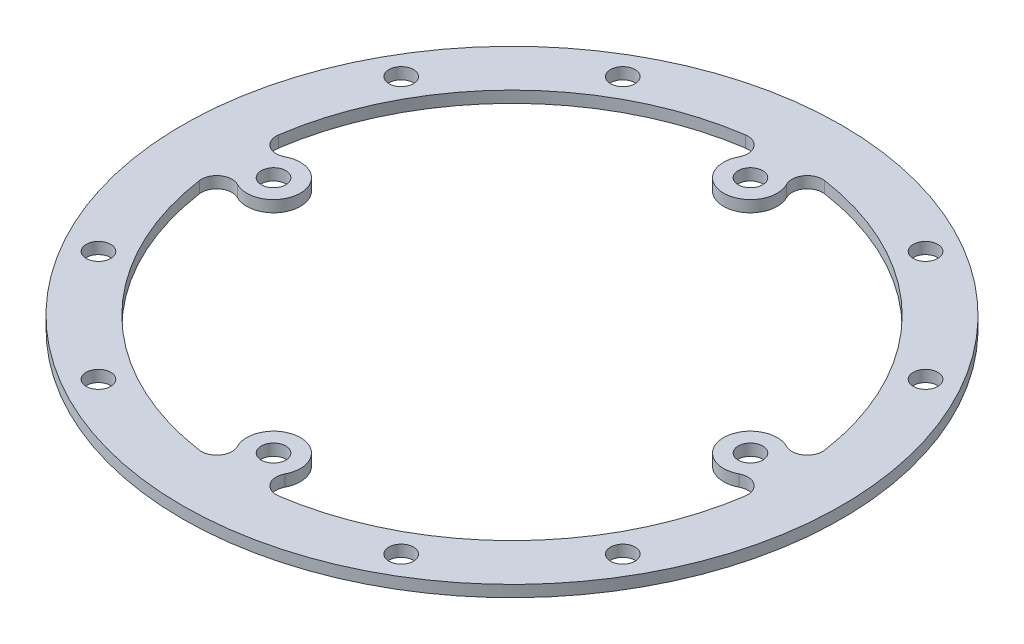
ISO-10303-21;
HEADER;
FILE_DESCRIPTION(('STEP AP214'),'2;1');
FILE_NAME('part.step','',(''),(''),'','','');
FILE_SCHEMA(('AUTOMOTIVE_DESIGN { 1 0 10303 214 1 1 1 1 }'));
ENDSEC;
DATA;
#1=APPLICATION_CONTEXT('core data for automotive mechanical design processes');
#2=APPLICATION_PROTOCOL_DEFINITION('international standard','automotive_design',2000,#1);
#3=PRODUCT_CONTEXT('',#1,'mechanical');
#4=PRODUCT('Part','Part','',(#3));
#5=PRODUCT_RELATED_PRODUCT_CATEGORY('part','',(#4));
#6=PRODUCT_DEFINITION_FORMATION('','',#4);
#7=PRODUCT_DEFINITION_CONTEXT('part definition',#1,'design');
#8=PRODUCT_DEFINITION('design','',#6,#7);
#9=PRODUCT_DEFINITION_SHAPE('','',#8);
#10=(LENGTH_UNIT() NAMED_UNIT(*) SI_UNIT(.MILLI.,.METRE.));
#11=(NAMED_UNIT(*) PLANE_ANGLE_UNIT() SI_UNIT($,.RADIAN.));
#12=(NAMED_UNIT(*) SI_UNIT($,.STERADIAN.) SOLID_ANGLE_UNIT());
#13=UNCERTAINTY_MEASURE_WITH_UNIT(LENGTH_MEASURE(1.E-05),#10,'distance_accuracy_value','');
#14=(GEOMETRIC_REPRESENTATION_CONTEXT(3) GLOBAL_UNCERTAINTY_ASSIGNED_CONTEXT((#13)) GLOBAL_UNIT_ASSIGNED_CONTEXT((#10,
#11,#12)) REPRESENTATION_CONTEXT('',''));
#15=CARTESIAN_POINT('',(0.,0.,0.));
#16=DIRECTION('',(0.,0.,1.));
#17=DIRECTION('',(1.,0.,0.));
#18=AXIS2_PLACEMENT_3D('',#15,#16,#17);
#19=CARTESIAN_POINT('',(0.,0.75,0.));
#20=DIRECTION('',(0.,-1.,0.));
#21=DIRECTION('',(0.,0.,-1.));
#22=AXIS2_PLACEMENT_3D('',#19,#20,#21);
#23=CYLINDRICAL_SURFACE('',#22,43.);
#24=CARTESIAN_POINT('',(0.,0.75,0.));
#25=DIRECTION('',(0.,1.,0.));
#26=DIRECTION('',(0.,0.,1.));
#27=AXIS2_PLACEMENT_3D('',#24,#25,#26);
#28=CIRCLE('',#27,43.);
#29=CARTESIAN_POINT('',(0.,0.75,43.));
#30=VERTEX_POINT('',#29);
#31=EDGE_CURVE('E11',#30,#30,#28,.T.);
#32=ORIENTED_EDGE('',*,*,#31,.F.);
#33=EDGE_LOOP('',(#32));
#34=FACE_BOUND('',#33,.T.);
#35=CARTESIAN_POINT('',(0.,-0.75,0.));
#36=DIRECTION('',(0.,1.,0.));
#37=DIRECTION('',(0.,0.,1.));
#38=AXIS2_PLACEMENT_3D('',#35,#36,#37);
#39=CIRCLE('',#38,43.);
#40=CARTESIAN_POINT('',(0.,-0.75,43.));
#41=VERTEX_POINT('',#40);
#42=EDGE_CURVE('E44',#41,#41,#39,.T.);
#43=ORIENTED_EDGE('',*,*,#42,.T.);
#44=EDGE_LOOP('',(#43));
#45=FACE_BOUND('',#44,.T.);
#46=ADVANCED_FACE('F41',(#34,#45),#23,.T.);
#47=CARTESIAN_POINT('',(0.,0.75,0.));
#48=DIRECTION('',(0.,1.,0.));
#49=DIRECTION('',(0.,0.,1.));
#50=AXIS2_PLACEMENT_3D('',#47,#48,#49);
#51=PLANE('',#50);
#52=CARTESIAN_POINT('',(-33.6478368888485,0.75,4.88088851557246));
#53=DIRECTION('',(0.,1.,0.));
#54=DIRECTION('',(0.,0.,1.));
#55=AXIS2_PLACEMENT_3D('',#52,#53,#54);
#56=CIRCLE('',#55,1.99999999999999);
#57=CARTESIAN_POINT('',(-32.7259683373429,0.75,3.1060199644552));
#58=VERTEX_POINT('',#57);
#59=CARTESIAN_POINT('',(-35.6271214117219,0.75,5.16799960472377));
#60=VERTEX_POINT('',#59);
#61=EDGE_CURVE('E55',#58,#60,#56,.T.);
#62=ORIENTED_EDGE('',*,*,#61,.F.);
#63=CARTESIAN_POINT('',(-31.1126983722082,0.75,0.));
#64=DIRECTION('',(0.,-1.,0.));
#65=DIRECTION('',(0.,0.,1.));
#66=AXIS2_PLACEMENT_3D('',#63,#64,#65);
#67=CIRCLE('',#66,3.5);
#68=CARTESIAN_POINT('',(-32.7259683373429,0.75,-3.1060199644552));
#69=VERTEX_POINT('',#68);
#70=EDGE_CURVE('E172',#69,#58,#67,.T.);
#71=ORIENTED_EDGE('',*,*,#70,.F.);
#72=CARTESIAN_POINT('',(-33.6478368888485,0.75,-4.88088851557246));
#73=DIRECTION('',(0.,1.,0.));
#74=DIRECTION('',(0.,0.,1.));
#75=AXIS2_PLACEMENT_3D('',#72,#73,#74);
#76=CIRCLE('',#75,2.);
#77=CARTESIAN_POINT('',(-35.6271214117219,0.75,-5.16799960472379));
#78=VERTEX_POINT('',#77);
#79=EDGE_CURVE('E175',#78,#69,#76,.T.);
#80=ORIENTED_EDGE('',*,*,#79,.F.);
#81=CARTESIAN_POINT('',(0.,0.75,0.));
#82=DIRECTION('',(0.,1.,0.));
#83=DIRECTION('',(0.,0.,1.));
#84=AXIS2_PLACEMENT_3D('',#81,#82,#83);
#85=CIRCLE('',#84,36.);
#86=CARTESIAN_POINT('',(-5.16799960472367,0.75,-35.627121411722));
#87=VERTEX_POINT('',#86);
#88=EDGE_CURVE('E251',#87,#78,#85,.T.);
#89=ORIENTED_EDGE('',*,*,#88,.F.);
#90=CARTESIAN_POINT('',(-4.88088851557246,0.75,-33.6478368888485));
#91=DIRECTION('',(0.,1.,0.));
#92=DIRECTION('',(0.,0.,1.));
#93=AXIS2_PLACEMENT_3D('',#90,#91,#92);
#94=CIRCLE('',#93,2.00000000000005);
#95=CARTESIAN_POINT('',(-3.10601996445509,0.75,-32.725968337343));
#96=VERTEX_POINT('',#95);
#97=EDGE_CURVE('E248',#96,#87,#94,.T.);
#98=ORIENTED_EDGE('',*,*,#97,.F.);
#99=CARTESIAN_POINT('',(1.08412565333123E-13,0.75,-31.1126983722083));
#100=DIRECTION('',(0.,-1.,0.));
#101=DIRECTION('',(0.,0.,1.));
#102=AXIS2_PLACEMENT_3D('',#99,#100,#101);
#103=CIRCLE('',#102,3.5);
#104=CARTESIAN_POINT('',(3.10601996445532,0.75,-32.7259683373429));
#105=VERTEX_POINT('',#104);
#106=EDGE_CURVE('E245',#105,#96,#103,.T.);
#107=ORIENTED_EDGE('',*,*,#106,.F.);
#108=CARTESIAN_POINT('',(4.88088851557258,0.75,-33.6478368888485));
#109=DIRECTION('',(0.,1.,0.));
#110=DIRECTION('',(0.,0.,1.));
#111=AXIS2_PLACEMENT_3D('',#108,#109,#110);
#112=CIRCLE('',#111,2.);
#113=CARTESIAN_POINT('',(5.16799960472391,0.75,-35.6271214117219));
#114=VERTEX_POINT('',#113);
#115=EDGE_CURVE('E242',#114,#105,#112,.T.);
#116=ORIENTED_EDGE('',*,*,#115,.F.);
#117=CARTESIAN_POINT('',(0.,0.75,0.));
#118=DIRECTION('',(0.,1.,0.));
#119=DIRECTION('',(0.,0.,1.));
#120=AXIS2_PLACEMENT_3D('',#117,#118,#119);
#121=CIRCLE('',#120,36.);
#122=CARTESIAN_POINT('',(35.627121411722,0.75,-5.16799960472353));
#123=VERTEX_POINT('',#122);
#124=EDGE_CURVE('E239',#123,#114,#121,.T.);
#125=ORIENTED_EDGE('',*,*,#124,.F.);
#126=CARTESIAN_POINT('',(33.6478368888485,0.75,-4.88088851557223));
#127=DIRECTION('',(0.,1.,0.));
#128=DIRECTION('',(0.,0.,1.));
#129=AXIS2_PLACEMENT_3D('',#126,#127,#128);
#130=CIRCLE('',#129,2.);
#131=CARTESIAN_POINT('',(32.725968337343,0.75,-3.10601996445498));
#132=VERTEX_POINT('',#131);
#133=EDGE_CURVE('E236',#132,#123,#130,.T.);
#134=ORIENTED_EDGE('',*,*,#133,.F.);
#135=CARTESIAN_POINT('',(31.1126983722082,0.75,2.17041971100743E-13));
#136=DIRECTION('',(0.,-1.,0.));
#137=DIRECTION('',(0.,0.,1.));
#138=AXIS2_PLACEMENT_3D('',#135,#136,#137);
#139=CIRCLE('',#138,3.5);
#140=CARTESIAN_POINT('',(32.7259683373429,0.75,3.10601996445543));
#141=VERTEX_POINT('',#140);
#142=EDGE_CURVE('E233',#141,#132,#139,.T.);
#143=ORIENTED_EDGE('',*,*,#142,.F.);
#144=CARTESIAN_POINT('',(33.6478368888484,0.75,4.8808885155727));
#145=DIRECTION('',(0.,1.,0.));
#146=DIRECTION('',(0.,0.,1.));
#147=AXIS2_PLACEMENT_3D('',#144,#145,#146);
#148=CIRCLE('',#147,2.);
#149=CARTESIAN_POINT('',(35.6271214117219,0.75,5.16799960472404));
#150=VERTEX_POINT('',#149);
#151=EDGE_CURVE('E230',#150,#141,#148,.T.);
#152=ORIENTED_EDGE('',*,*,#151,.F.);
#153=CARTESIAN_POINT('',(0.,0.75,0.));
#154=DIRECTION('',(0.,1.,0.));
#155=DIRECTION('',(0.,0.,1.));
#156=AXIS2_PLACEMENT_3D('',#153,#154,#155);
#157=CIRCLE('',#156,36.);
#158=CARTESIAN_POINT('',(5.16799960472341,0.75,35.627121411722));
#159=VERTEX_POINT('',#158);
#160=EDGE_CURVE('E227',#159,#150,#157,.T.);
#161=ORIENTED_EDGE('',*,*,#160,.F.);
#162=CARTESIAN_POINT('',(4.88088851557211,0.75,33.6478368888485));
#163=DIRECTION('',(0.,1.,0.));
#164=DIRECTION('',(0.,0.,1.));
#165=AXIS2_PLACEMENT_3D('',#162,#163,#164);
#166=CIRCLE('',#165,2.);
#167=CARTESIAN_POINT('',(3.10601996445486,0.75,32.725968337343));
#168=VERTEX_POINT('',#167);
#169=EDGE_CURVE('E224',#168,#159,#166,.T.);
#170=ORIENTED_EDGE('',*,*,#169,.F.);
#171=CARTESIAN_POINT('',(-3.25671376868364E-13,0.75,31.1126983722082));
#172=DIRECTION('',(0.,-1.,0.));
#173=DIRECTION('',(0.,0.,1.));
#174=AXIS2_PLACEMENT_3D('',#171,#172,#173);
#175=CIRCLE('',#174,3.5);
#176=CARTESIAN_POINT('',(-3.10601996445555,0.75,32.7259683373429));
#177=VERTEX_POINT('',#176);
#178=EDGE_CURVE('E221',#177,#168,#175,.T.);
#179=ORIENTED_EDGE('',*,*,#178,.F.);
#180=CARTESIAN_POINT('',(-4.88088851557282,0.75,33.6478368888484));
#181=DIRECTION('',(0.,1.,0.));
#182=DIRECTION('',(0.,0.,1.));
#183=AXIS2_PLACEMENT_3D('',#180,#181,#182);
#184=CIRCLE('',#183,2.);
#185=CARTESIAN_POINT('',(-5.16799960472417,0.75,35.6271214117219));
#186=VERTEX_POINT('',#185);
#187=EDGE_CURVE('E218',#186,#177,#184,.T.);
#188=ORIENTED_EDGE('',*,*,#187,.F.);
#189=CARTESIAN_POINT('',(0.,0.75,0.));
#190=DIRECTION('',(0.,1.,0.));
#191=DIRECTION('',(0.,0.,1.));
#192=AXIS2_PLACEMENT_3D('',#189,#190,#191);
#193=CIRCLE('',#192,36.);
#194=EDGE_CURVE('E216',#60,#186,#193,.T.);
#195=ORIENTED_EDGE('',*,*,#194,.F.);
#196=EDGE_LOOP('',(#62,#71,#80,#89,#98,#107,#116,#125,#134,#143,#152,#161,#170,#179,#188,#195));
#197=FACE_BOUND('',#196,.T.);
#198=CARTESIAN_POINT('',(-34.2080034494853,0.750000000000001,-19.75));
#199=DIRECTION('',(0.,1.,0.));
#200=DIRECTION('',(0.,0.,1.));
#201=AXIS2_PLACEMENT_3D('',#198,#199,#200);
#202=CIRCLE('',#201,1.59999999999999);
#203=CARTESIAN_POINT('',(-34.2080034494853,0.750000000000001,-18.15));
#204=VERTEX_POINT('',#203);
#205=EDGE_CURVE('E258',#204,#204,#202,.T.);
#206=ORIENTED_EDGE('',*,*,#205,.F.);
#207=EDGE_LOOP('',(#206));
#208=FACE_BOUND('',#207,.T.);
#209=CARTESIAN_POINT('',(-34.2080034494853,0.750000000000001,19.7500000000001));
#210=DIRECTION('',(0.,1.,0.));
#211=DIRECTION('',(0.,0.,1.));
#212=AXIS2_PLACEMENT_3D('',#209,#210,#211);
#213=CIRCLE('',#212,1.59999999999999);
#214=CARTESIAN_POINT('',(-34.2080034494853,0.750000000000001,21.35));
#215=VERTEX_POINT('',#214);
#216=EDGE_CURVE('E291',#215,#215,#213,.T.);
#217=ORIENTED_EDGE('',*,*,#216,.F.);
#218=EDGE_LOOP('',(#217));
#219=FACE_BOUND('',#218,.T.);
#220=CARTESIAN_POINT('',(-31.1126983722082,0.750000000000001,0.));
#221=DIRECTION('',(0.,1.,0.));
#222=DIRECTION('',(0.,0.,1.));
#223=AXIS2_PLACEMENT_3D('',#220,#221,#222);
#224=CIRCLE('',#223,1.59999999999999);
#225=CARTESIAN_POINT('',(-31.1126983722082,0.750000000000001,1.59999999999999));
#226=VERTEX_POINT('',#225);
#227=EDGE_CURVE('E297',#226,#226,#224,.T.);
#228=ORIENTED_EDGE('',*,*,#227,.F.);
#229=EDGE_LOOP('',(#228));
#230=FACE_BOUND('',#229,.T.);
#231=CARTESIAN_POINT('',(19.75,0.750000000000001,-34.2080034494853));
#232=DIRECTION('',(0.,1.,0.));
#233=DIRECTION('',(0.,0.,1.));
#234=AXIS2_PLACEMENT_3D('',#231,#232,#233);
#235=CIRCLE('',#234,1.59999999999999);
#236=CARTESIAN_POINT('',(19.75,0.750000000000001,-32.6080034494853));
#237=VERTEX_POINT('',#236);
#238=EDGE_CURVE('E303',#237,#237,#235,.T.);
#239=ORIENTED_EDGE('',*,*,#238,.F.);
#240=EDGE_LOOP('',(#239));
#241=FACE_BOUND('',#240,.T.);
#242=CARTESIAN_POINT('',(-19.7500000000001,0.750000000000001,-34.2080034494853));
#243=DIRECTION('',(0.,1.,0.));
#244=DIRECTION('',(0.,0.,1.));
#245=AXIS2_PLACEMENT_3D('',#242,#243,#244);
#246=CIRCLE('',#245,1.59999999999999);
#247=CARTESIAN_POINT('',(-19.7500000000001,0.750000000000001,-32.6080034494853));
#248=VERTEX_POINT('',#247);
#249=EDGE_CURVE('E309',#248,#248,#246,.T.);
#250=ORIENTED_EDGE('',*,*,#249,.F.);
#251=EDGE_LOOP('',(#250));
#252=FACE_BOUND('',#251,.T.);
#253=CARTESIAN_POINT('',(0.,0.750000000000001,-31.1126983722082));
#254=DIRECTION('',(0.,1.,0.));
#255=DIRECTION('',(0.,0.,1.));
#256=AXIS2_PLACEMENT_3D('',#253,#254,#255);
#257=CIRCLE('',#256,1.59999999999999);
#258=CARTESIAN_POINT('',(0.,0.750000000000001,-29.5126983722082));
#259=VERTEX_POINT('',#258);
#260=EDGE_CURVE('E315',#259,#259,#257,.T.);
#261=ORIENTED_EDGE('',*,*,#260,.F.);
#262=EDGE_LOOP('',(#261));
#263=FACE_BOUND('',#262,.T.);
#264=CARTESIAN_POINT('',(34.2080034494853,0.750000000000001,19.75));
#265=DIRECTION('',(0.,1.,0.));
#266=DIRECTION('',(0.,0.,1.));
#267=AXIS2_PLACEMENT_3D('',#264,#265,#266);
#268=CIRCLE('',#267,1.59999999999999);
#269=CARTESIAN_POINT('',(34.2080034494853,0.750000000000001,21.35));
#270=VERTEX_POINT('',#269);
#271=EDGE_CURVE('E321',#270,#270,#268,.T.);
#272=ORIENTED_EDGE('',*,*,#271,.F.);
#273=EDGE_LOOP('',(#272));
#274=FACE_BOUND('',#273,.T.);
#275=CARTESIAN_POINT('',(34.2080034494853,0.750000000000001,-19.7500000000001));
#276=DIRECTION('',(0.,1.,0.));
#277=DIRECTION('',(0.,0.,1.));
#278=AXIS2_PLACEMENT_3D('',#275,#276,#277);
#279=CIRCLE('',#278,1.59999999999999);
#280=CARTESIAN_POINT('',(34.2080034494853,0.750000000000001,-18.1500000000001));
#281=VERTEX_POINT('',#280);
#282=EDGE_CURVE('E327',#281,#281,#279,.T.);
#283=ORIENTED_EDGE('',*,*,#282,.F.);
#284=EDGE_LOOP('',(#283));
#285=FACE_BOUND('',#284,.T.);
#286=CARTESIAN_POINT('',(31.1126983722082,0.750000000000001,0.));
#287=DIRECTION('',(0.,1.,0.));
#288=DIRECTION('',(0.,0.,1.));
#289=AXIS2_PLACEMENT_3D('',#286,#287,#288);
#290=CIRCLE('',#289,1.59999999999998);
#291=CARTESIAN_POINT('',(31.1126983722082,0.750000000000001,1.59999999999998));
#292=VERTEX_POINT('',#291);
#293=EDGE_CURVE('E333',#292,#292,#290,.T.);
#294=ORIENTED_EDGE('',*,*,#293,.F.);
#295=EDGE_LOOP('',(#294));
#296=FACE_BOUND('',#295,.T.);
#297=CARTESIAN_POINT('',(-19.75,0.750000000000001,34.2080034494853));
#298=DIRECTION('',(0.,1.,0.));
#299=DIRECTION('',(0.,0.,1.));
#300=AXIS2_PLACEMENT_3D('',#297,#298,#299);
#301=CIRCLE('',#300,1.59999999999999);
#302=CARTESIAN_POINT('',(-19.75,0.750000000000001,35.8080034494853));
#303=VERTEX_POINT('',#302);
#304=EDGE_CURVE('E339',#303,#303,#301,.T.);
#305=ORIENTED_EDGE('',*,*,#304,.F.);
#306=EDGE_LOOP('',(#305));
#307=FACE_BOUND('',#306,.T.);
#308=CARTESIAN_POINT('',(19.7500000000001,0.750000000000001,34.2080034494853));
#309=DIRECTION('',(0.,1.,0.));
#310=DIRECTION('',(0.,0.,1.));
#311=AXIS2_PLACEMENT_3D('',#308,#309,#310);
#312=CIRCLE('',#311,1.59999999999999);
#313=CARTESIAN_POINT('',(19.7500000000001,0.750000000000001,35.8080034494853));
#314=VERTEX_POINT('',#313);
#315=EDGE_CURVE('E345',#314,#314,#312,.T.);
#316=ORIENTED_EDGE('',*,*,#315,.F.);
#317=EDGE_LOOP('',(#316));
#318=FACE_BOUND('',#317,.T.);
#319=CARTESIAN_POINT('',(0.,0.750000000000001,31.1126983722082));
#320=DIRECTION('',(0.,1.,0.));
#321=DIRECTION('',(0.,0.,1.));
#322=AXIS2_PLACEMENT_3D('',#319,#320,#321);
#323=CIRCLE('',#322,1.59999999999999);
#324=CARTESIAN_POINT('',(0.,0.750000000000001,32.7126983722082));
#325=VERTEX_POINT('',#324);
#326=EDGE_CURVE('E351',#325,#325,#323,.T.);
#327=ORIENTED_EDGE('',*,*,#326,.F.);
#328=EDGE_LOOP('',(#327));
#329=FACE_BOUND('',#328,.T.);
#330=ORIENTED_EDGE('',*,*,#31,.T.);
#331=EDGE_LOOP('',(#330));
#332=FACE_BOUND('',#331,.T.);
#333=ADVANCED_FACE('F364',(#197,#208,#219,#230,#241,#252,#263,#274,#285,#296,#307,#318,#329,
#332),#51,.T.);
#334=CARTESIAN_POINT('',(0.,-0.75,0.));
#335=DIRECTION('',(0.,1.,0.));
#336=DIRECTION('',(0.,0.,1.));
#337=AXIS2_PLACEMENT_3D('',#334,#335,#336);
#338=PLANE('',#337);
#339=CARTESIAN_POINT('',(-31.1126983722082,-0.75,0.));
#340=DIRECTION('',(0.,-1.,0.));
#341=DIRECTION('',(0.,0.,1.));
#342=AXIS2_PLACEMENT_3D('',#339,#340,#341);
#343=CIRCLE('',#342,3.5);
#344=CARTESIAN_POINT('',(-32.7259683373429,-0.75,-3.1060199644552));
#345=VERTEX_POINT('',#344);
#346=CARTESIAN_POINT('',(-32.7259683373429,-0.75,3.1060199644552));
#347=VERTEX_POINT('',#346);
#348=EDGE_CURVE('E161',#345,#347,#343,.T.);
#349=ORIENTED_EDGE('',*,*,#348,.T.);
#350=CARTESIAN_POINT('',(-33.6478368888485,-0.75,4.88088851557246));
#351=DIRECTION('',(0.,1.,0.));
#352=DIRECTION('',(0.,0.,1.));
#353=AXIS2_PLACEMENT_3D('',#350,#351,#352);
#354=CIRCLE('',#353,1.99999999999999);
#355=CARTESIAN_POINT('',(-35.6271214117219,-0.75,5.16799960472377));
#356=VERTEX_POINT('',#355);
#357=EDGE_CURVE('E155',#347,#356,#354,.T.);
#358=ORIENTED_EDGE('',*,*,#357,.T.);
#359=CARTESIAN_POINT('',(0.,-0.75,0.));
#360=DIRECTION('',(0.,1.,0.));
#361=DIRECTION('',(0.,0.,1.));
#362=AXIS2_PLACEMENT_3D('',#359,#360,#361);
#363=CIRCLE('',#362,36.);
#364=CARTESIAN_POINT('',(-5.16799960472417,-0.75,35.6271214117219));
#365=VERTEX_POINT('',#364);
#366=EDGE_CURVE('E164',#356,#365,#363,.T.);
#367=ORIENTED_EDGE('',*,*,#366,.T.);
#368=CARTESIAN_POINT('',(-4.88088851557282,-0.75,33.6478368888484));
#369=DIRECTION('',(0.,1.,0.));
#370=DIRECTION('',(0.,0.,1.));
#371=AXIS2_PLACEMENT_3D('',#368,#369,#370);
#372=CIRCLE('',#371,2.);
#373=CARTESIAN_POINT('',(-3.10601996445555,-0.75,32.7259683373429));
#374=VERTEX_POINT('',#373);
#375=EDGE_CURVE('E63',#365,#374,#372,.T.);
#376=ORIENTED_EDGE('',*,*,#375,.T.);
#377=CARTESIAN_POINT('',(-3.25671376868364E-13,-0.75,31.1126983722082));
#378=DIRECTION('',(0.,-1.,0.));
#379=DIRECTION('',(0.,0.,1.));
#380=AXIS2_PLACEMENT_3D('',#377,#378,#379);
#381=CIRCLE('',#380,3.5);
#382=CARTESIAN_POINT('',(3.10601996445486,-0.75,32.725968337343));
#383=VERTEX_POINT('',#382);
#384=EDGE_CURVE('E179',#374,#383,#381,.T.);
#385=ORIENTED_EDGE('',*,*,#384,.T.);
#386=CARTESIAN_POINT('',(4.88088851557211,-0.75,33.6478368888485));
#387=DIRECTION('',(0.,1.,0.));
#388=DIRECTION('',(0.,0.,1.));
#389=AXIS2_PLACEMENT_3D('',#386,#387,#388);
#390=CIRCLE('',#389,2.);
#391=CARTESIAN_POINT('',(5.16799960472341,-0.75,35.627121411722));
#392=VERTEX_POINT('',#391);
#393=EDGE_CURVE('E182',#383,#392,#390,.T.);
#394=ORIENTED_EDGE('',*,*,#393,.T.);
#395=CARTESIAN_POINT('',(0.,-0.75,0.));
#396=DIRECTION('',(0.,1.,0.));
#397=DIRECTION('',(0.,0.,1.));
#398=AXIS2_PLACEMENT_3D('',#395,#396,#397);
#399=CIRCLE('',#398,36.);
#400=CARTESIAN_POINT('',(35.6271214117219,-0.75,5.16799960472404));
#401=VERTEX_POINT('',#400);
#402=EDGE_CURVE('E185',#392,#401,#399,.T.);
#403=ORIENTED_EDGE('',*,*,#402,.T.);
#404=CARTESIAN_POINT('',(33.6478368888484,-0.75,4.8808885155727));
#405=DIRECTION('',(0.,1.,0.));
#406=DIRECTION('',(0.,0.,1.));
#407=AXIS2_PLACEMENT_3D('',#404,#405,#406);
#408=CIRCLE('',#407,2.);
#409=CARTESIAN_POINT('',(32.7259683373429,-0.75,3.10601996445543));
#410=VERTEX_POINT('',#409);
#411=EDGE_CURVE('E188',#401,#410,#408,.T.);
#412=ORIENTED_EDGE('',*,*,#411,.T.);
#413=CARTESIAN_POINT('',(31.1126983722082,-0.75,2.17041971100743E-13));
#414=DIRECTION('',(0.,-1.,0.));
#415=DIRECTION('',(0.,0.,1.));
#416=AXIS2_PLACEMENT_3D('',#413,#414,#415);
#417=CIRCLE('',#416,3.5);
#418=CARTESIAN_POINT('',(32.725968337343,-0.75,-3.10601996445498));
#419=VERTEX_POINT('',#418);
#420=EDGE_CURVE('E191',#410,#419,#417,.T.);
#421=ORIENTED_EDGE('',*,*,#420,.T.);
#422=CARTESIAN_POINT('',(33.6478368888485,-0.75,-4.88088851557223));
#423=DIRECTION('',(0.,1.,0.));
#424=DIRECTION('',(0.,0.,1.));
#425=AXIS2_PLACEMENT_3D('',#422,#423,#424);
#426=CIRCLE('',#425,2.);
#427=CARTESIAN_POINT('',(35.627121411722,-0.75,-5.16799960472353));
#428=VERTEX_POINT('',#427);
#429=EDGE_CURVE('E194',#419,#428,#426,.T.);
#430=ORIENTED_EDGE('',*,*,#429,.T.);
#431=CARTESIAN_POINT('',(0.,-0.75,0.));
#432=DIRECTION('',(0.,1.,0.));
#433=DIRECTION('',(0.,0.,1.));
#434=AXIS2_PLACEMENT_3D('',#431,#432,#433);
#435=CIRCLE('',#434,36.);
#436=CARTESIAN_POINT('',(5.16799960472391,-0.75,-35.6271214117219));
#437=VERTEX_POINT('',#436);
#438=EDGE_CURVE('E197',#428,#437,#435,.T.);
#439=ORIENTED_EDGE('',*,*,#438,.T.);
#440=CARTESIAN_POINT('',(4.88088851557258,-0.75,-33.6478368888485));
#441=DIRECTION('',(0.,1.,0.));
#442=DIRECTION('',(0.,0.,1.));
#443=AXIS2_PLACEMENT_3D('',#440,#441,#442);
#444=CIRCLE('',#443,2.);
#445=CARTESIAN_POINT('',(3.10601996445532,-0.75,-32.7259683373429));
#446=VERTEX_POINT('',#445);
#447=EDGE_CURVE('E200',#437,#446,#444,.T.);
#448=ORIENTED_EDGE('',*,*,#447,.T.);
#449=CARTESIAN_POINT('',(1.08412565333123E-13,-0.75,-31.1126983722083));
#450=DIRECTION('',(0.,-1.,0.));
#451=DIRECTION('',(0.,0.,1.));
#452=AXIS2_PLACEMENT_3D('',#449,#450,#451);
#453=CIRCLE('',#452,3.5);
#454=CARTESIAN_POINT('',(-3.10601996445509,-0.75,-32.725968337343));
#455=VERTEX_POINT('',#454);
#456=EDGE_CURVE('E203',#446,#455,#453,.T.);
#457=ORIENTED_EDGE('',*,*,#456,.T.);
#458=CARTESIAN_POINT('',(-4.88088851557246,-0.75,-33.6478368888485));
#459=DIRECTION('',(0.,1.,0.));
#460=DIRECTION('',(0.,0.,1.));
#461=AXIS2_PLACEMENT_3D('',#458,#459,#460);
#462=CIRCLE('',#461,2.00000000000005);
#463=CARTESIAN_POINT('',(-5.16799960472367,-0.75,-35.627121411722));
#464=VERTEX_POINT('',#463);
#465=EDGE_CURVE('E206',#455,#464,#462,.T.);
#466=ORIENTED_EDGE('',*,*,#465,.T.);
#467=CARTESIAN_POINT('',(0.,-0.75,0.));
#468=DIRECTION('',(0.,1.,0.));
#469=DIRECTION('',(0.,0.,1.));
#470=AXIS2_PLACEMENT_3D('',#467,#468,#469);
#471=CIRCLE('',#470,36.);
#472=CARTESIAN_POINT('',(-35.6271214117219,-0.75,-5.16799960472379));
#473=VERTEX_POINT('',#472);
#474=EDGE_CURVE('E209',#464,#473,#471,.T.);
#475=ORIENTED_EDGE('',*,*,#474,.T.);
#476=CARTESIAN_POINT('',(-33.6478368888485,-0.75,-4.88088851557246));
#477=DIRECTION('',(0.,1.,0.));
#478=DIRECTION('',(0.,0.,1.));
#479=AXIS2_PLACEMENT_3D('',#476,#477,#478);
#480=CIRCLE('',#479,2.);
#481=EDGE_CURVE('E212',#473,#345,#480,.T.);
#482=ORIENTED_EDGE('',*,*,#481,.T.);
#483=EDGE_LOOP('',(#349,#358,#367,#376,#385,#394,#403,#412,#421,#430,#439,#448,#457,#466,#475,#482));
#484=FACE_BOUND('',#483,.T.);
#485=CARTESIAN_POINT('',(-34.2080034494853,-0.75,-19.75));
#486=DIRECTION('',(0.,1.,0.));
#487=DIRECTION('',(0.,0.,1.));
#488=AXIS2_PLACEMENT_3D('',#485,#486,#487);
#489=CIRCLE('',#488,1.6);
#490=CARTESIAN_POINT('',(-34.2080034494853,-0.75,-18.15));
#491=VERTEX_POINT('',#490);
#492=EDGE_CURVE('E288',#491,#491,#489,.T.);
#493=ORIENTED_EDGE('',*,*,#492,.T.);
#494=EDGE_LOOP('',(#493));
#495=FACE_BOUND('',#494,.T.);
#496=CARTESIAN_POINT('',(-34.2080034494853,-0.75,19.7500000000001));
#497=DIRECTION('',(0.,1.,0.));
#498=DIRECTION('',(0.,0.,1.));
#499=AXIS2_PLACEMENT_3D('',#496,#497,#498);
#500=CIRCLE('',#499,1.6);
#501=CARTESIAN_POINT('',(-34.2080034494853,-0.75,21.3500000000001));
#502=VERTEX_POINT('',#501);
#503=EDGE_CURVE('E294',#502,#502,#500,.T.);
#504=ORIENTED_EDGE('',*,*,#503,.T.);
#505=EDGE_LOOP('',(#504));
#506=FACE_BOUND('',#505,.T.);
#507=CARTESIAN_POINT('',(-31.1126983722082,-0.75,0.));
#508=DIRECTION('',(0.,1.,0.));
#509=DIRECTION('',(0.,0.,1.));
#510=AXIS2_PLACEMENT_3D('',#507,#508,#509);
#511=CIRCLE('',#510,1.6);
#512=CARTESIAN_POINT('',(-31.1126983722082,-0.75,1.6));
#513=VERTEX_POINT('',#512);
#514=EDGE_CURVE('E300',#513,#513,#511,.T.);
#515=ORIENTED_EDGE('',*,*,#514,.T.);
#516=EDGE_LOOP('',(#515));
#517=FACE_BOUND('',#516,.T.);
#518=CARTESIAN_POINT('',(19.75,-0.75,-34.2080034494853));
#519=DIRECTION('',(0.,1.,0.));
#520=DIRECTION('',(0.,0.,1.));
#521=AXIS2_PLACEMENT_3D('',#518,#519,#520);
#522=CIRCLE('',#521,1.6);
#523=CARTESIAN_POINT('',(19.75,-0.75,-32.6080034494853));
#524=VERTEX_POINT('',#523);
#525=EDGE_CURVE('E306',#524,#524,#522,.T.);
#526=ORIENTED_EDGE('',*,*,#525,.T.);
#527=EDGE_LOOP('',(#526));
#528=FACE_BOUND('',#527,.T.);
#529=CARTESIAN_POINT('',(-19.7500000000001,-0.75,-34.2080034494853));
#530=DIRECTION('',(0.,1.,0.));
#531=DIRECTION('',(0.,0.,1.));
#532=AXIS2_PLACEMENT_3D('',#529,#530,#531);
#533=CIRCLE('',#532,1.6);
#534=CARTESIAN_POINT('',(-19.7500000000001,-0.75,-32.6080034494853));
#535=VERTEX_POINT('',#534);
#536=EDGE_CURVE('E312',#535,#535,#533,.T.);
#537=ORIENTED_EDGE('',*,*,#536,.T.);
#538=EDGE_LOOP('',(#537));
#539=FACE_BOUND('',#538,.T.);
#540=CARTESIAN_POINT('',(0.,-0.75,-31.1126983722082));
#541=DIRECTION('',(0.,1.,0.));
#542=DIRECTION('',(0.,0.,1.));
#543=AXIS2_PLACEMENT_3D('',#540,#541,#542);
#544=CIRCLE('',#543,1.6);
#545=CARTESIAN_POINT('',(0.,-0.75,-29.5126983722082));
#546=VERTEX_POINT('',#545);
#547=EDGE_CURVE('E318',#546,#546,#544,.T.);
#548=ORIENTED_EDGE('',*,*,#547,.T.);
#549=EDGE_LOOP('',(#548));
#550=FACE_BOUND('',#549,.T.);
#551=CARTESIAN_POINT('',(34.2080034494853,-0.75,19.75));
#552=DIRECTION('',(0.,1.,0.));
#553=DIRECTION('',(0.,0.,1.));
#554=AXIS2_PLACEMENT_3D('',#551,#552,#553);
#555=CIRCLE('',#554,1.6);
#556=CARTESIAN_POINT('',(34.2080034494853,-0.75,21.35));
#557=VERTEX_POINT('',#556);
#558=EDGE_CURVE('E324',#557,#557,#555,.T.);
#559=ORIENTED_EDGE('',*,*,#558,.T.);
#560=EDGE_LOOP('',(#559));
#561=FACE_BOUND('',#560,.T.);
#562=CARTESIAN_POINT('',(34.2080034494853,-0.75,-19.7500000000001));
#563=DIRECTION('',(0.,1.,0.));
#564=DIRECTION('',(0.,0.,1.));
#565=AXIS2_PLACEMENT_3D('',#562,#563,#564);
#566=CIRCLE('',#565,1.6);
#567=CARTESIAN_POINT('',(34.2080034494853,-0.75,-18.1500000000001));
#568=VERTEX_POINT('',#567);
#569=EDGE_CURVE('E330',#568,#568,#566,.T.);
#570=ORIENTED_EDGE('',*,*,#569,.T.);
#571=EDGE_LOOP('',(#570));
#572=FACE_BOUND('',#571,.T.);
#573=CARTESIAN_POINT('',(31.1126983722082,-0.75,0.));
#574=DIRECTION('',(0.,1.,0.));
#575=DIRECTION('',(0.,0.,1.));
#576=AXIS2_PLACEMENT_3D('',#573,#574,#575);
#577=CIRCLE('',#576,1.6);
#578=CARTESIAN_POINT('',(31.1126983722082,-0.75,1.59999999999999));
#579=VERTEX_POINT('',#578);
#580=EDGE_CURVE('E336',#579,#579,#577,.T.);
#581=ORIENTED_EDGE('',*,*,#580,.T.);
#582=EDGE_LOOP('',(#581));
#583=FACE_BOUND('',#582,.T.);
#584=CARTESIAN_POINT('',(-19.75,-0.75,34.2080034494853));
#585=DIRECTION('',(0.,1.,0.));
#586=DIRECTION('',(0.,0.,1.));
#587=AXIS2_PLACEMENT_3D('',#584,#585,#586);
#588=CIRCLE('',#587,1.6);
#589=CARTESIAN_POINT('',(-19.75,-0.75,35.8080034494853));
#590=VERTEX_POINT('',#589);
#591=EDGE_CURVE('E342',#590,#590,#588,.T.);
#592=ORIENTED_EDGE('',*,*,#591,.T.);
#593=EDGE_LOOP('',(#592));
#594=FACE_BOUND('',#593,.T.);
#595=CARTESIAN_POINT('',(19.7500000000001,-0.75,34.2080034494853));
#596=DIRECTION('',(0.,1.,0.));
#597=DIRECTION('',(0.,0.,1.));
#598=AXIS2_PLACEMENT_3D('',#595,#596,#597);
#599=CIRCLE('',#598,1.6);
#600=CARTESIAN_POINT('',(19.7500000000001,-0.75,35.8080034494853));
#601=VERTEX_POINT('',#600);
#602=EDGE_CURVE('E348',#601,#601,#599,.T.);
#603=ORIENTED_EDGE('',*,*,#602,.T.);
#604=EDGE_LOOP('',(#603));
#605=FACE_BOUND('',#604,.T.);
#606=CARTESIAN_POINT('',(0.,-0.75,31.1126983722082));
#607=DIRECTION('',(0.,1.,0.));
#608=DIRECTION('',(0.,0.,1.));
#609=AXIS2_PLACEMENT_3D('',#606,#607,#608);
#610=CIRCLE('',#609,1.6);
#611=CARTESIAN_POINT('',(0.,-0.75,32.7126983722082));
#612=VERTEX_POINT('',#611);
#613=EDGE_CURVE('E354',#612,#612,#610,.T.);
#614=ORIENTED_EDGE('',*,*,#613,.T.);
#615=EDGE_LOOP('',(#614));
#616=FACE_BOUND('',#615,.T.);
#617=ORIENTED_EDGE('',*,*,#42,.F.);
#618=EDGE_LOOP('',(#617));
#619=FACE_BOUND('',#618,.T.);
#620=ADVANCED_FACE('F168',(#484,#495,#506,#517,#528,#539,#550,#561,#572,#583,#594,#605,#616,
#619),#338,.F.);
#621=CARTESIAN_POINT('',(0.,0.75,31.1126983722082));
#622=DIRECTION('',(0.,1.,0.));
#623=DIRECTION('',(0.,0.,1.));
#624=AXIS2_PLACEMENT_3D('',#621,#622,#623);
#625=CYLINDRICAL_SURFACE('',#624,1.59999999999999);
#626=ORIENTED_EDGE('',*,*,#613,.F.);
#627=EDGE_LOOP('',(#626));
#628=FACE_BOUND('',#627,.T.);
#629=ORIENTED_EDGE('',*,*,#326,.T.);
#630=EDGE_LOOP('',(#629));
#631=FACE_BOUND('',#630,.T.);
#632=ADVANCED_FACE('F363',(#628,#631),#625,.F.);
#633=CARTESIAN_POINT('',(19.7500000000001,0.75,34.2080034494853));
#634=DIRECTION('',(0.,1.,0.));
#635=DIRECTION('',(0.,0.,1.));
#636=AXIS2_PLACEMENT_3D('',#633,#634,#635);
#637=CYLINDRICAL_SURFACE('',#636,1.59999999999999);
#638=ORIENTED_EDGE('',*,*,#602,.F.);
#639=EDGE_LOOP('',(#638));
#640=FACE_BOUND('',#639,.T.);
#641=ORIENTED_EDGE('',*,*,#315,.T.);
#642=EDGE_LOOP('',(#641));
#643=FACE_BOUND('',#642,.T.);
#644=ADVANCED_FACE('F369',(#640,#643),#637,.F.);
#645=CARTESIAN_POINT('',(-19.75,0.75,34.2080034494853));
#646=DIRECTION('',(0.,1.,0.));
#647=DIRECTION('',(0.,0.,1.));
#648=AXIS2_PLACEMENT_3D('',#645,#646,#647);
#649=CYLINDRICAL_SURFACE('',#648,1.59999999999999);
#650=ORIENTED_EDGE('',*,*,#591,.F.);
#651=EDGE_LOOP('',(#650));
#652=FACE_BOUND('',#651,.T.);
#653=ORIENTED_EDGE('',*,*,#304,.T.);
#654=EDGE_LOOP('',(#653));
#655=FACE_BOUND('',#654,.T.);
#656=ADVANCED_FACE('F588',(#652,#655),#649,.F.);
#657=CARTESIAN_POINT('',(31.1126983722082,0.75,0.));
#658=DIRECTION('',(0.,1.,0.));
#659=DIRECTION('',(0.,0.,1.));
#660=AXIS2_PLACEMENT_3D('',#657,#658,#659);
#661=CYLINDRICAL_SURFACE('',#660,1.59999999999999);
#662=ORIENTED_EDGE('',*,*,#580,.F.);
#663=EDGE_LOOP('',(#662));
#664=FACE_BOUND('',#663,.T.);
#665=ORIENTED_EDGE('',*,*,#293,.T.);
#666=EDGE_LOOP('',(#665));
#667=FACE_BOUND('',#666,.T.);
#668=ADVANCED_FACE('F584',(#664,#667),#661,.F.);
#669=CARTESIAN_POINT('',(34.2080034494853,0.75,-19.7500000000001));
#670=DIRECTION('',(0.,1.,0.));
#671=DIRECTION('',(0.,0.,1.));
#672=AXIS2_PLACEMENT_3D('',#669,#670,#671);
#673=CYLINDRICAL_SURFACE('',#672,1.59999999999999);
#674=ORIENTED_EDGE('',*,*,#569,.F.);
#675=EDGE_LOOP('',(#674));
#676=FACE_BOUND('',#675,.T.);
#677=ORIENTED_EDGE('',*,*,#282,.T.);
#678=EDGE_LOOP('',(#677));
#679=FACE_BOUND('',#678,.T.);
#680=ADVANCED_FACE('F580',(#676,#679),#673,.F.);
#681=CARTESIAN_POINT('',(34.2080034494853,0.75,19.75));
#682=DIRECTION('',(0.,1.,0.));
#683=DIRECTION('',(0.,0.,1.));
#684=AXIS2_PLACEMENT_3D('',#681,#682,#683);
#685=CYLINDRICAL_SURFACE('',#684,1.59999999999999);
#686=ORIENTED_EDGE('',*,*,#558,.F.);
#687=EDGE_LOOP('',(#686));
#688=FACE_BOUND('',#687,.T.);
#689=ORIENTED_EDGE('',*,*,#271,.T.);
#690=EDGE_LOOP('',(#689));
#691=FACE_BOUND('',#690,.T.);
#692=ADVANCED_FACE('F576',(#688,#691),#685,.F.);
#693=CARTESIAN_POINT('',(0.,0.75,-31.1126983722082));
#694=DIRECTION('',(0.,1.,0.));
#695=DIRECTION('',(0.,0.,1.));
#696=AXIS2_PLACEMENT_3D('',#693,#694,#695);
#697=CYLINDRICAL_SURFACE('',#696,1.59999999999999);
#698=ORIENTED_EDGE('',*,*,#547,.F.);
#699=EDGE_LOOP('',(#698));
#700=FACE_BOUND('',#699,.T.);
#701=ORIENTED_EDGE('',*,*,#260,.T.);
#702=EDGE_LOOP('',(#701));
#703=FACE_BOUND('',#702,.T.);
#704=ADVANCED_FACE('F572',(#700,#703),#697,.F.);
#705=CARTESIAN_POINT('',(-19.7500000000001,0.75,-34.2080034494853));
#706=DIRECTION('',(0.,1.,0.));
#707=DIRECTION('',(0.,0.,1.));
#708=AXIS2_PLACEMENT_3D('',#705,#706,#707);
#709=CYLINDRICAL_SURFACE('',#708,1.59999999999999);
#710=ORIENTED_EDGE('',*,*,#536,.F.);
#711=EDGE_LOOP('',(#710));
#712=FACE_BOUND('',#711,.T.);
#713=ORIENTED_EDGE('',*,*,#249,.T.);
#714=EDGE_LOOP('',(#713));
#715=FACE_BOUND('',#714,.T.);
#716=ADVANCED_FACE('F568',(#712,#715),#709,.F.);
#717=CARTESIAN_POINT('',(19.75,0.75,-34.2080034494853));
#718=DIRECTION('',(0.,1.,0.));
#719=DIRECTION('',(0.,0.,1.));
#720=AXIS2_PLACEMENT_3D('',#717,#718,#719);
#721=CYLINDRICAL_SURFACE('',#720,1.59999999999999);
#722=ORIENTED_EDGE('',*,*,#525,.F.);
#723=EDGE_LOOP('',(#722));
#724=FACE_BOUND('',#723,.T.);
#725=ORIENTED_EDGE('',*,*,#238,.T.);
#726=EDGE_LOOP('',(#725));
#727=FACE_BOUND('',#726,.T.);
#728=ADVANCED_FACE('F564',(#724,#727),#721,.F.);
#729=CARTESIAN_POINT('',(-31.1126983722082,0.75,0.));
#730=DIRECTION('',(0.,1.,0.));
#731=DIRECTION('',(0.,0.,1.));
#732=AXIS2_PLACEMENT_3D('',#729,#730,#731);
#733=CYLINDRICAL_SURFACE('',#732,1.59999999999999);
#734=ORIENTED_EDGE('',*,*,#514,.F.);
#735=EDGE_LOOP('',(#734));
#736=FACE_BOUND('',#735,.T.);
#737=ORIENTED_EDGE('',*,*,#227,.T.);
#738=EDGE_LOOP('',(#737));
#739=FACE_BOUND('',#738,.T.);
#740=ADVANCED_FACE('F560',(#736,#739),#733,.F.);
#741=CARTESIAN_POINT('',(-34.2080034494853,0.75,19.7500000000001));
#742=DIRECTION('',(0.,1.,0.));
#743=DIRECTION('',(0.,0.,1.));
#744=AXIS2_PLACEMENT_3D('',#741,#742,#743);
#745=CYLINDRICAL_SURFACE('',#744,1.59999999999999);
#746=ORIENTED_EDGE('',*,*,#503,.F.);
#747=EDGE_LOOP('',(#746));
#748=FACE_BOUND('',#747,.T.);
#749=ORIENTED_EDGE('',*,*,#216,.T.);
#750=EDGE_LOOP('',(#749));
#751=FACE_BOUND('',#750,.T.);
#752=ADVANCED_FACE('F556',(#748,#751),#745,.F.);
#753=CARTESIAN_POINT('',(-34.2080034494853,0.75,-19.75));
#754=DIRECTION('',(0.,1.,0.));
#755=DIRECTION('',(0.,0.,1.));
#756=AXIS2_PLACEMENT_3D('',#753,#754,#755);
#757=CYLINDRICAL_SURFACE('',#756,1.59999999999999);
#758=ORIENTED_EDGE('',*,*,#492,.F.);
#759=EDGE_LOOP('',(#758));
#760=FACE_BOUND('',#759,.T.);
#761=ORIENTED_EDGE('',*,*,#205,.T.);
#762=EDGE_LOOP('',(#761));
#763=FACE_BOUND('',#762,.T.);
#764=ADVANCED_FACE('F402',(#760,#763),#757,.F.);
#765=CARTESIAN_POINT('',(-33.6478368888485,-0.75,4.88088851557246));
#766=DIRECTION('',(0.,1.,0.));
#767=DIRECTION('',(0.,0.,1.));
#768=AXIS2_PLACEMENT_3D('',#765,#766,#767);
#769=CYLINDRICAL_SURFACE('',#768,1.99999999999999);
#770=ORIENTED_EDGE('',*,*,#61,.T.);
#771=DIRECTION('',(0.,1.,0.));
#772=VECTOR('',#771,1.);
#773=CARTESIAN_POINT('',(-35.6271214117219,-0.75,5.16799960472377));
#774=LINE('',#773,#772);
#775=EDGE_CURVE('E151',#356,#60,#774,.T.);
#776=ORIENTED_EDGE('',*,*,#775,.F.);
#777=ORIENTED_EDGE('',*,*,#357,.F.);
#778=DIRECTION('',(0.,1.,0.));
#779=VECTOR('',#778,1.);
#780=CARTESIAN_POINT('',(-32.7259683373429,-0.75,3.1060199644552));
#781=LINE('',#780,#779);
#782=EDGE_CURVE('E256',#347,#58,#781,.T.);
#783=ORIENTED_EDGE('',*,*,#782,.T.);
#784=EDGE_LOOP('',(#770,#776,#777,#783));
#785=FACE_BOUND('',#784,.T.);
#786=ADVANCED_FACE('F153',(#785),#769,.F.);
#787=CARTESIAN_POINT('',(-31.1126983722082,-0.75,0.));
#788=DIRECTION('',(0.,1.,0.));
#789=DIRECTION('',(0.,0.,1.));
#790=AXIS2_PLACEMENT_3D('',#787,#788,#789);
#791=CYLINDRICAL_SURFACE('',#790,3.5);
#792=ORIENTED_EDGE('',*,*,#70,.T.);
#793=ORIENTED_EDGE('',*,*,#782,.F.);
#794=ORIENTED_EDGE('',*,*,#348,.F.);
#795=DIRECTION('',(0.,1.,0.));
#796=VECTOR('',#795,1.);
#797=CARTESIAN_POINT('',(-32.7259683373429,-0.75,-3.1060199644552));
#798=LINE('',#797,#796);
#799=EDGE_CURVE('E259',#345,#69,#798,.T.);
#800=ORIENTED_EDGE('',*,*,#799,.T.);
#801=EDGE_LOOP('',(#792,#793,#794,#800));
#802=FACE_BOUND('',#801,.T.);
#803=ADVANCED_FACE('F401',(#802),#791,.T.);
#804=CARTESIAN_POINT('',(-33.6478368888485,-0.75,-4.88088851557246));
#805=DIRECTION('',(0.,1.,0.));
#806=DIRECTION('',(0.,0.,1.));
#807=AXIS2_PLACEMENT_3D('',#804,#805,#806);
#808=CYLINDRICAL_SURFACE('',#807,2.);
#809=ORIENTED_EDGE('',*,*,#79,.T.);
#810=ORIENTED_EDGE('',*,*,#799,.F.);
#811=ORIENTED_EDGE('',*,*,#481,.F.);
#812=DIRECTION('',(0.,1.,0.));
#813=VECTOR('',#812,1.);
#814=CARTESIAN_POINT('',(-35.6271214117219,-0.75,-5.16799960472379));
#815=LINE('',#814,#813);
#816=EDGE_CURVE('E261',#473,#78,#815,.T.);
#817=ORIENTED_EDGE('',*,*,#816,.T.);
#818=EDGE_LOOP('',(#809,#810,#811,#817));
#819=FACE_BOUND('',#818,.T.);
#820=ADVANCED_FACE('F413',(#819),#808,.F.);
#821=CARTESIAN_POINT('',(0.,-0.75,0.));
#822=DIRECTION('',(0.,1.,0.));
#823=DIRECTION('',(0.,0.,1.));
#824=AXIS2_PLACEMENT_3D('',#821,#822,#823);
#825=CYLINDRICAL_SURFACE('',#824,36.);
#826=ORIENTED_EDGE('',*,*,#88,.T.);
#827=ORIENTED_EDGE('',*,*,#816,.F.);
#828=ORIENTED_EDGE('',*,*,#474,.F.);
#829=DIRECTION('',(0.,1.,0.));
#830=VECTOR('',#829,1.);
#831=CARTESIAN_POINT('',(-5.16799960472367,-0.75,-35.627121411722));
#832=LINE('',#831,#830);
#833=EDGE_CURVE('E263',#464,#87,#832,.T.);
#834=ORIENTED_EDGE('',*,*,#833,.T.);
#835=EDGE_LOOP('',(#826,#827,#828,#834));
#836=FACE_BOUND('',#835,.T.);
#837=ADVANCED_FACE('F423',(#836),#825,.F.);
#838=CARTESIAN_POINT('',(-4.88088851557246,-0.75,-33.6478368888485));
#839=DIRECTION('',(0.,1.,0.));
#840=DIRECTION('',(0.,0.,1.));
#841=AXIS2_PLACEMENT_3D('',#838,#839,#840);
#842=CYLINDRICAL_SURFACE('',#841,2.00000000000005);
#843=ORIENTED_EDGE('',*,*,#97,.T.);
#844=ORIENTED_EDGE('',*,*,#833,.F.);
#845=ORIENTED_EDGE('',*,*,#465,.F.);
#846=DIRECTION('',(0.,1.,0.));
#847=VECTOR('',#846,1.);
#848=CARTESIAN_POINT('',(-3.10601996445509,-0.75,-32.725968337343));
#849=LINE('',#848,#847);
#850=EDGE_CURVE('E265',#455,#96,#849,.T.);
#851=ORIENTED_EDGE('',*,*,#850,.T.);
#852=EDGE_LOOP('',(#843,#844,#845,#851));
#853=FACE_BOUND('',#852,.T.);
#854=ADVANCED_FACE('F433',(#853),#842,.F.);
#855=CARTESIAN_POINT('',(1.08412565333123E-13,-0.75,-31.1126983722083));
#856=DIRECTION('',(0.,1.,0.));
#857=DIRECTION('',(0.,0.,1.));
#858=AXIS2_PLACEMENT_3D('',#855,#856,#857);
#859=CYLINDRICAL_SURFACE('',#858,3.5);
#860=ORIENTED_EDGE('',*,*,#106,.T.);
#861=ORIENTED_EDGE('',*,*,#850,.F.);
#862=ORIENTED_EDGE('',*,*,#456,.F.);
#863=DIRECTION('',(0.,1.,0.));
#864=VECTOR('',#863,1.);
#865=CARTESIAN_POINT('',(3.10601996445532,-0.75,-32.7259683373429));
#866=LINE('',#865,#864);
#867=EDGE_CURVE('E267',#446,#105,#866,.T.);
#868=ORIENTED_EDGE('',*,*,#867,.T.);
#869=EDGE_LOOP('',(#860,#861,#862,#868));
#870=FACE_BOUND('',#869,.T.);
#871=ADVANCED_FACE('F443',(#870),#859,.T.);
#872=CARTESIAN_POINT('',(4.88088851557258,-0.75,-33.6478368888485));
#873=DIRECTION('',(0.,1.,0.));
#874=DIRECTION('',(0.,0.,1.));
#875=AXIS2_PLACEMENT_3D('',#872,#873,#874);
#876=CYLINDRICAL_SURFACE('',#875,2.);
#877=ORIENTED_EDGE('',*,*,#115,.T.);
#878=ORIENTED_EDGE('',*,*,#867,.F.);
#879=ORIENTED_EDGE('',*,*,#447,.F.);
#880=DIRECTION('',(0.,1.,0.));
#881=VECTOR('',#880,1.);
#882=CARTESIAN_POINT('',(5.16799960472391,-0.75,-35.6271214117219));
#883=LINE('',#882,#881);
#884=EDGE_CURVE('E269',#437,#114,#883,.T.);
#885=ORIENTED_EDGE('',*,*,#884,.T.);
#886=EDGE_LOOP('',(#877,#878,#879,#885));
#887=FACE_BOUND('',#886,.T.);
#888=ADVANCED_FACE('F453',(#887),#876,.F.);
#889=CARTESIAN_POINT('',(0.,-0.75,0.));
#890=DIRECTION('',(0.,1.,0.));
#891=DIRECTION('',(0.,0.,1.));
#892=AXIS2_PLACEMENT_3D('',#889,#890,#891);
#893=CYLINDRICAL_SURFACE('',#892,36.);
#894=ORIENTED_EDGE('',*,*,#124,.T.);
#895=ORIENTED_EDGE('',*,*,#884,.F.);
#896=ORIENTED_EDGE('',*,*,#438,.F.);
#897=DIRECTION('',(0.,1.,0.));
#898=VECTOR('',#897,1.);
#899=CARTESIAN_POINT('',(35.627121411722,-0.75,-5.16799960472353));
#900=LINE('',#899,#898);
#901=EDGE_CURVE('E271',#428,#123,#900,.T.);
#902=ORIENTED_EDGE('',*,*,#901,.T.);
#903=EDGE_LOOP('',(#894,#895,#896,#902));
#904=FACE_BOUND('',#903,.T.);
#905=ADVANCED_FACE('F463',(#904),#893,.F.);
#906=CARTESIAN_POINT('',(33.6478368888485,-0.75,-4.88088851557223));
#907=DIRECTION('',(0.,1.,0.));
#908=DIRECTION('',(0.,0.,1.));
#909=AXIS2_PLACEMENT_3D('',#906,#907,#908);
#910=CYLINDRICAL_SURFACE('',#909,2.);
#911=ORIENTED_EDGE('',*,*,#133,.T.);
#912=ORIENTED_EDGE('',*,*,#901,.F.);
#913=ORIENTED_EDGE('',*,*,#429,.F.);
#914=DIRECTION('',(0.,1.,0.));
#915=VECTOR('',#914,1.);
#916=CARTESIAN_POINT('',(32.725968337343,-0.75,-3.10601996445498));
#917=LINE('',#916,#915);
#918=EDGE_CURVE('E273',#419,#132,#917,.T.);
#919=ORIENTED_EDGE('',*,*,#918,.T.);
#920=EDGE_LOOP('',(#911,#912,#913,#919));
#921=FACE_BOUND('',#920,.T.);
#922=ADVANCED_FACE('F473',(#921),#910,.F.);
#923=CARTESIAN_POINT('',(31.1126983722082,-0.75,2.17041971100743E-13));
#924=DIRECTION('',(0.,1.,0.));
#925=DIRECTION('',(0.,0.,1.));
#926=AXIS2_PLACEMENT_3D('',#923,#924,#925);
#927=CYLINDRICAL_SURFACE('',#926,3.5);
#928=ORIENTED_EDGE('',*,*,#142,.T.);
#929=ORIENTED_EDGE('',*,*,#918,.F.);
#930=ORIENTED_EDGE('',*,*,#420,.F.);
#931=DIRECTION('',(0.,1.,0.));
#932=VECTOR('',#931,1.);
#933=CARTESIAN_POINT('',(32.7259683373429,-0.75,3.10601996445543));
#934=LINE('',#933,#932);
#935=EDGE_CURVE('E275',#410,#141,#934,.T.);
#936=ORIENTED_EDGE('',*,*,#935,.T.);
#937=EDGE_LOOP('',(#928,#929,#930,#936));
#938=FACE_BOUND('',#937,.T.);
#939=ADVANCED_FACE('F483',(#938),#927,.T.);
#940=CARTESIAN_POINT('',(33.6478368888484,-0.75,4.8808885155727));
#941=DIRECTION('',(0.,1.,0.));
#942=DIRECTION('',(0.,0.,1.));
#943=AXIS2_PLACEMENT_3D('',#940,#941,#942);
#944=CYLINDRICAL_SURFACE('',#943,2.);
#945=ORIENTED_EDGE('',*,*,#151,.T.);
#946=ORIENTED_EDGE('',*,*,#935,.F.);
#947=ORIENTED_EDGE('',*,*,#411,.F.);
#948=DIRECTION('',(0.,1.,0.));
#949=VECTOR('',#948,1.);
#950=CARTESIAN_POINT('',(35.6271214117219,-0.75,5.16799960472404));
#951=LINE('',#950,#949);
#952=EDGE_CURVE('E277',#401,#150,#951,.T.);
#953=ORIENTED_EDGE('',*,*,#952,.T.);
#954=EDGE_LOOP('',(#945,#946,#947,#953));
#955=FACE_BOUND('',#954,.T.);
#956=ADVANCED_FACE('F493',(#955),#944,.F.);
#957=CARTESIAN_POINT('',(0.,-0.75,0.));
#958=DIRECTION('',(0.,1.,0.));
#959=DIRECTION('',(0.,0.,1.));
#960=AXIS2_PLACEMENT_3D('',#957,#958,#959);
#961=CYLINDRICAL_SURFACE('',#960,36.);
#962=ORIENTED_EDGE('',*,*,#160,.T.);
#963=ORIENTED_EDGE('',*,*,#952,.F.);
#964=ORIENTED_EDGE('',*,*,#402,.F.);
#965=DIRECTION('',(0.,1.,0.));
#966=VECTOR('',#965,1.);
#967=CARTESIAN_POINT('',(5.16799960472341,-0.75,35.627121411722));
#968=LINE('',#967,#966);
#969=EDGE_CURVE('E279',#392,#159,#968,.T.);
#970=ORIENTED_EDGE('',*,*,#969,.T.);
#971=EDGE_LOOP('',(#962,#963,#964,#970));
#972=FACE_BOUND('',#971,.T.);
#973=ADVANCED_FACE('F503',(#972),#961,.F.);
#974=CARTESIAN_POINT('',(4.88088851557211,-0.75,33.6478368888485));
#975=DIRECTION('',(0.,1.,0.));
#976=DIRECTION('',(0.,0.,1.));
#977=AXIS2_PLACEMENT_3D('',#974,#975,#976);
#978=CYLINDRICAL_SURFACE('',#977,2.);
#979=ORIENTED_EDGE('',*,*,#169,.T.);
#980=ORIENTED_EDGE('',*,*,#969,.F.);
#981=ORIENTED_EDGE('',*,*,#393,.F.);
#982=DIRECTION('',(0.,1.,0.));
#983=VECTOR('',#982,1.);
#984=CARTESIAN_POINT('',(3.10601996445486,-0.75,32.725968337343));
#985=LINE('',#984,#983);
#986=EDGE_CURVE('E281',#383,#168,#985,.T.);
#987=ORIENTED_EDGE('',*,*,#986,.T.);
#988=EDGE_LOOP('',(#979,#980,#981,#987));
#989=FACE_BOUND('',#988,.T.);
#990=ADVANCED_FACE('F513',(#989),#978,.F.);
#991=CARTESIAN_POINT('',(-3.25671376868364E-13,-0.75,31.1126983722082));
#992=DIRECTION('',(0.,1.,0.));
#993=DIRECTION('',(0.,0.,1.));
#994=AXIS2_PLACEMENT_3D('',#991,#992,#993);
#995=CYLINDRICAL_SURFACE('',#994,3.5);
#996=ORIENTED_EDGE('',*,*,#178,.T.);
#997=ORIENTED_EDGE('',*,*,#986,.F.);
#998=ORIENTED_EDGE('',*,*,#384,.F.);
#999=DIRECTION('',(0.,1.,0.));
#1000=VECTOR('',#999,1.);
#1001=CARTESIAN_POINT('',(-3.10601996445555,-0.75,32.7259683373429));
#1002=LINE('',#1001,#1000);
#1003=EDGE_CURVE('E283',#374,#177,#1002,.T.);
#1004=ORIENTED_EDGE('',*,*,#1003,.T.);
#1005=EDGE_LOOP('',(#996,#997,#998,#1004));
#1006=FACE_BOUND('',#1005,.T.);
#1007=ADVANCED_FACE('F523',(#1006),#995,.T.);
#1008=CARTESIAN_POINT('',(-4.88088851557282,-0.75,33.6478368888484));
#1009=DIRECTION('',(0.,1.,0.));
#1010=DIRECTION('',(0.,0.,1.));
#1011=AXIS2_PLACEMENT_3D('',#1008,#1009,#1010);
#1012=CYLINDRICAL_SURFACE('',#1011,2.);
#1013=ORIENTED_EDGE('',*,*,#187,.T.);
#1014=ORIENTED_EDGE('',*,*,#1003,.F.);
#1015=ORIENTED_EDGE('',*,*,#375,.F.);
#1016=DIRECTION('',(0.,1.,0.));
#1017=VECTOR('',#1016,1.);
#1018=CARTESIAN_POINT('',(-5.16799960472417,-0.75,35.6271214117219));
#1019=LINE('',#1018,#1017);
#1020=EDGE_CURVE('E160',#365,#186,#1019,.T.);
#1021=ORIENTED_EDGE('',*,*,#1020,.T.);
#1022=EDGE_LOOP('',(#1013,#1014,#1015,#1021));
#1023=FACE_BOUND('',#1022,.T.);
#1024=ADVANCED_FACE('F533',(#1023),#1012,.F.);
#1025=CARTESIAN_POINT('',(0.,-0.75,0.));
#1026=DIRECTION('',(0.,1.,0.));
#1027=DIRECTION('',(0.,0.,1.));
#1028=AXIS2_PLACEMENT_3D('',#1025,#1026,#1027);
#1029=CYLINDRICAL_SURFACE('',#1028,36.);
#1030=ORIENTED_EDGE('',*,*,#194,.T.);
#1031=ORIENTED_EDGE('',*,*,#1020,.F.);
#1032=ORIENTED_EDGE('',*,*,#366,.F.);
#1033=ORIENTED_EDGE('',*,*,#775,.T.);
#1034=EDGE_LOOP('',(#1030,#1031,#1032,#1033));
#1035=FACE_BOUND('',#1034,.T.);
#1036=ADVANCED_FACE('F165',(#1035),#1029,.F.);
#1037=CLOSED_SHELL('',(#46,#333,#620,#632,#644,#656,#668,#680,#692,#704,#716,#728,#740,#752,
#764,#786,#803,#820,#837,#854,#871,#888,#905,#922,#939,#956,#973,#990,#1007,#1024,#1036));
#1038=MANIFOLD_SOLID_BREP('B2',#1037);
#1039=ADVANCED_BREP_SHAPE_REPRESENTATION('',(#18,#1038),#14);
#1040=SHAPE_DEFINITION_REPRESENTATION(#9,#1039);
ENDSEC;
END-ISO-10303-21;
